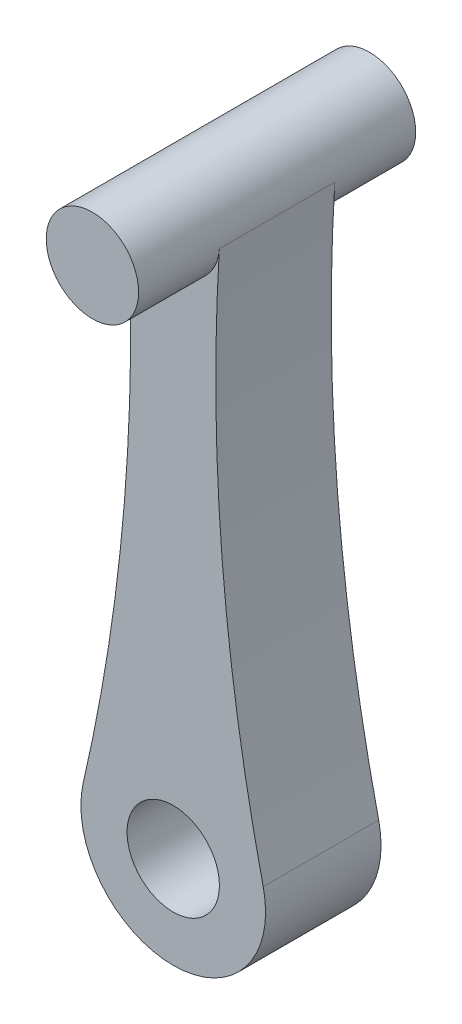
ISO-10303-21;
HEADER;
FILE_DESCRIPTION(('STEP AP214'),'2;1');
FILE_NAME('part.step','',(''),(''),'','','');
FILE_SCHEMA(('AUTOMOTIVE_DESIGN { 1 0 10303 214 1 1 1 1 }'));
ENDSEC;
DATA;
#1=APPLICATION_CONTEXT('core data for automotive mechanical design processes');
#2=APPLICATION_PROTOCOL_DEFINITION('international standard','automotive_design',2000,#1);
#3=PRODUCT_CONTEXT('',#1,'mechanical');
#4=PRODUCT('Part','Part','',(#3));
#5=PRODUCT_RELATED_PRODUCT_CATEGORY('part','',(#4));
#6=PRODUCT_DEFINITION_FORMATION('','',#4);
#7=PRODUCT_DEFINITION_CONTEXT('part definition',#1,'design');
#8=PRODUCT_DEFINITION('design','',#6,#7);
#9=PRODUCT_DEFINITION_SHAPE('','',#8);
#10=(LENGTH_UNIT() NAMED_UNIT(*) SI_UNIT(.MILLI.,.METRE.));
#11=(NAMED_UNIT(*) PLANE_ANGLE_UNIT() SI_UNIT($,.RADIAN.));
#12=(NAMED_UNIT(*) SI_UNIT($,.STERADIAN.) SOLID_ANGLE_UNIT());
#13=UNCERTAINTY_MEASURE_WITH_UNIT(LENGTH_MEASURE(1.E-05),#10,'distance_accuracy_value','');
#14=(GEOMETRIC_REPRESENTATION_CONTEXT(3) GLOBAL_UNCERTAINTY_ASSIGNED_CONTEXT((#13)) GLOBAL_UNIT_ASSIGNED_CONTEXT((#10,
#11,#12)) REPRESENTATION_CONTEXT('',''));
#15=CARTESIAN_POINT('',(0.,0.,0.));
#16=DIRECTION('',(0.,0.,1.));
#17=DIRECTION('',(1.,0.,0.));
#18=AXIS2_PLACEMENT_3D('',#15,#16,#17);
#19=CARTESIAN_POINT('',(-204.605714152584,-12.7083333333333,-12.5));
#20=DIRECTION('',(0.,0.,-1.));
#21=DIRECTION('',(-1.,0.,0.));
#22=AXIS2_PLACEMENT_3D('',#19,#20,#21);
#23=PLANE('',#22);
#24=CARTESIAN_POINT('',(0.,-60.,-12.5));
#25=DIRECTION('',(0.,0.,1.));
#26=DIRECTION('',(1.,0.,0.));
#27=AXIS2_PLACEMENT_3D('',#24,#25,#26);
#28=CIRCLE('',#27,10.);
#29=CARTESIAN_POINT('',(10.,-60.,-12.5));
#30=VERTEX_POINT('',#29);
#31=EDGE_CURVE('E108',#30,#30,#28,.T.);
#32=ORIENTED_EDGE('',*,*,#31,.T.);
#33=EDGE_LOOP('',(#32));
#34=FACE_BOUND('',#33,.T.);
#35=CARTESIAN_POINT('',(-409.211428305168,34.5833333333333,-12.5));
#36=DIRECTION('',(0.,0.,-1.));
#37=DIRECTION('',(-1.,0.,0.));
#38=AXIS2_PLACEMENT_3D('',#35,#36,#37);
#39=CIRCLE('',#38,400.);
#40=CARTESIAN_POINT('',(-9.98076654402844,59.380081300813,-12.5));
#41=VERTEX_POINT('',#40);
#42=CARTESIAN_POINT('',(-19.4862584907223,-55.4960317460317,-12.5));
#43=VERTEX_POINT('',#42);
#44=EDGE_CURVE('E89',#41,#43,#39,.T.);
#45=ORIENTED_EDGE('',*,*,#44,.F.);
#46=CARTESIAN_POINT('',(0.,60.,-12.5));
#47=DIRECTION('',(0.,0.,1.));
#48=DIRECTION('',(1.,0.,0.));
#49=AXIS2_PLACEMENT_3D('',#46,#47,#48);
#50=CIRCLE('',#49,9.99999999999997);
#51=CARTESIAN_POINT('',(9.98076654402847,59.380081300813,-12.5));
#52=VERTEX_POINT('',#51);
#53=EDGE_CURVE('E58',#41,#52,#50,.T.);
#54=ORIENTED_EDGE('',*,*,#53,.T.);
#55=CARTESIAN_POINT('',(409.211428305168,34.5833333333334,-12.5));
#56=DIRECTION('',(0.,0.,-1.));
#57=DIRECTION('',(1.,0.,0.));
#58=AXIS2_PLACEMENT_3D('',#55,#56,#57);
#59=CIRCLE('',#58,400.);
#60=CARTESIAN_POINT('',(19.4862584907222,-55.4960317460316,-12.5));
#61=VERTEX_POINT('',#60);
#62=EDGE_CURVE('E86',#61,#52,#59,.T.);
#63=ORIENTED_EDGE('',*,*,#62,.F.);
#64=CARTESIAN_POINT('',(0.,-60.,-12.5));
#65=DIRECTION('',(0.,0.,1.));
#66=DIRECTION('',(1.,0.,0.));
#67=AXIS2_PLACEMENT_3D('',#64,#65,#66);
#68=CIRCLE('',#67,20.);
#69=EDGE_CURVE('E101',#43,#61,#68,.T.);
#70=ORIENTED_EDGE('',*,*,#69,.F.);
#71=EDGE_LOOP('',(#45,#54,#63,#70));
#72=FACE_BOUND('',#71,.T.);
#73=ADVANCED_FACE('F42',(#34,#72),#23,.T.);
#74=CARTESIAN_POINT('',(-204.605714152584,-12.7083333333333,12.5));
#75=DIRECTION('',(0.,0.,-1.));
#76=DIRECTION('',(-1.,0.,0.));
#77=AXIS2_PLACEMENT_3D('',#74,#75,#76);
#78=PLANE('',#77);
#79=CARTESIAN_POINT('',(0.,-60.,12.5));
#80=DIRECTION('',(0.,0.,1.));
#81=DIRECTION('',(1.,0.,0.));
#82=AXIS2_PLACEMENT_3D('',#79,#80,#81);
#83=CIRCLE('',#82,10.);
#84=CARTESIAN_POINT('',(10.,-60.,12.5));
#85=VERTEX_POINT('',#84);
#86=EDGE_CURVE('E118',#85,#85,#83,.T.);
#87=ORIENTED_EDGE('',*,*,#86,.F.);
#88=EDGE_LOOP('',(#87));
#89=FACE_BOUND('',#88,.T.);
#90=CARTESIAN_POINT('',(0.,60.,12.5));
#91=DIRECTION('',(0.,0.,1.));
#92=DIRECTION('',(1.,0.,0.));
#93=AXIS2_PLACEMENT_3D('',#90,#91,#92);
#94=CIRCLE('',#93,9.99999999999997);
#95=CARTESIAN_POINT('',(-9.98076654402844,59.380081300813,12.5));
#96=VERTEX_POINT('',#95);
#97=CARTESIAN_POINT('',(9.98076654402847,59.380081300813,12.5));
#98=VERTEX_POINT('',#97);
#99=EDGE_CURVE('E96',#96,#98,#94,.T.);
#100=ORIENTED_EDGE('',*,*,#99,.F.);
#101=CARTESIAN_POINT('',(-409.211428305168,34.5833333333333,12.5));
#102=DIRECTION('',(0.,0.,-1.));
#103=DIRECTION('',(-1.,0.,0.));
#104=AXIS2_PLACEMENT_3D('',#101,#102,#103);
#105=CIRCLE('',#104,400.);
#106=CARTESIAN_POINT('',(-19.4862584907223,-55.4960317460317,12.5));
#107=VERTEX_POINT('',#106);
#108=EDGE_CURVE('E125',#96,#107,#105,.T.);
#109=ORIENTED_EDGE('',*,*,#108,.T.);
#110=CARTESIAN_POINT('',(0.,-60.,12.5));
#111=DIRECTION('',(0.,0.,1.));
#112=DIRECTION('',(1.,0.,0.));
#113=AXIS2_PLACEMENT_3D('',#110,#111,#112);
#114=CIRCLE('',#113,20.);
#115=CARTESIAN_POINT('',(19.4862584907222,-55.4960317460316,12.5));
#116=VERTEX_POINT('',#115);
#117=EDGE_CURVE('E128',#107,#116,#114,.T.);
#118=ORIENTED_EDGE('',*,*,#117,.T.);
#119=CARTESIAN_POINT('',(409.211428305168,34.5833333333334,12.5));
#120=DIRECTION('',(0.,0.,-1.));
#121=DIRECTION('',(1.,0.,0.));
#122=AXIS2_PLACEMENT_3D('',#119,#120,#121);
#123=CIRCLE('',#122,400.);
#124=EDGE_CURVE('E134',#116,#98,#123,.T.);
#125=ORIENTED_EDGE('',*,*,#124,.T.);
#126=EDGE_LOOP('',(#100,#109,#118,#125));
#127=FACE_BOUND('',#126,.T.);
#128=ADVANCED_FACE('F143',(#89,#127),#78,.F.);
#129=CARTESIAN_POINT('',(-409.211428305168,34.5833333333333,-12.5));
#130=DIRECTION('',(0.,0.,1.));
#131=DIRECTION('',(1.,0.,0.));
#132=AXIS2_PLACEMENT_3D('',#129,#130,#131);
#133=CYLINDRICAL_SURFACE('',#132,400.);
#134=DIRECTION('',(0.,0.,1.));
#135=VECTOR('',#134,1.);
#136=CARTESIAN_POINT('',(-19.4862584907223,-55.4960317460317,-12.5));
#137=LINE('',#136,#135);
#138=EDGE_CURVE('E100',#43,#107,#137,.T.);
#139=ORIENTED_EDGE('',*,*,#138,.T.);
#140=ORIENTED_EDGE('',*,*,#108,.F.);
#141=DIRECTION('',(0.,0.,1.));
#142=VECTOR('',#141,1.);
#143=CARTESIAN_POINT('',(-9.98076654402844,59.380081300813,-12.5));
#144=LINE('',#143,#142);
#145=EDGE_CURVE('E11',#41,#96,#144,.T.);
#146=ORIENTED_EDGE('',*,*,#145,.F.);
#147=ORIENTED_EDGE('',*,*,#44,.T.);
#148=EDGE_LOOP('',(#139,#140,#146,#147));
#149=FACE_BOUND('',#148,.T.);
#150=ADVANCED_FACE('F44',(#149),#133,.F.);
#151=CARTESIAN_POINT('',(0.,60.,-12.5));
#152=DIRECTION('',(0.,0.,1.));
#153=DIRECTION('',(1.,0.,0.));
#154=AXIS2_PLACEMENT_3D('',#151,#152,#153);
#155=CYLINDRICAL_SURFACE('',#154,9.99999999999997);
#156=ORIENTED_EDGE('',*,*,#145,.T.);
#157=ORIENTED_EDGE('',*,*,#99,.T.);
#158=DIRECTION('',(0.,0.,1.));
#159=VECTOR('',#158,1.);
#160=CARTESIAN_POINT('',(9.98076654402847,59.380081300813,-12.5));
#161=LINE('',#160,#159);
#162=EDGE_CURVE('E51',#52,#98,#161,.T.);
#163=ORIENTED_EDGE('',*,*,#162,.F.);
#164=ORIENTED_EDGE('',*,*,#53,.F.);
#165=EDGE_LOOP('',(#156,#157,#163,#164));
#166=FACE_BOUND('',#165,.T.);
#167=CARTESIAN_POINT('',(0.,60.,30.));
#168=DIRECTION('',(0.,0.,1.));
#169=DIRECTION('',(1.,0.,0.));
#170=AXIS2_PLACEMENT_3D('',#167,#168,#169);
#171=CIRCLE('',#170,9.99999999999997);
#172=CARTESIAN_POINT('',(9.99999999999999,60.,30.));
#173=VERTEX_POINT('',#172);
#174=EDGE_CURVE('E115',#173,#173,#171,.T.);
#175=ORIENTED_EDGE('',*,*,#174,.F.);
#176=EDGE_LOOP('',(#175));
#177=FACE_BOUND('',#176,.T.);
#178=CARTESIAN_POINT('',(0.,60.,-30.));
#179=DIRECTION('',(0.,0.,1.));
#180=DIRECTION('',(1.,0.,0.));
#181=AXIS2_PLACEMENT_3D('',#178,#179,#180);
#182=CIRCLE('',#181,9.99999999999997);
#183=CARTESIAN_POINT('',(9.99999999999999,60.,-30.));
#184=VERTEX_POINT('',#183);
#185=EDGE_CURVE('E90',#184,#184,#182,.T.);
#186=ORIENTED_EDGE('',*,*,#185,.T.);
#187=EDGE_LOOP('',(#186));
#188=FACE_BOUND('',#187,.T.);
#189=ADVANCED_FACE('F93',(#166,#177,#188),#155,.T.);
#190=CARTESIAN_POINT('',(409.211428305168,34.5833333333334,-12.5));
#191=DIRECTION('',(0.,0.,1.));
#192=DIRECTION('',(1.,0.,0.));
#193=AXIS2_PLACEMENT_3D('',#190,#191,#192);
#194=CYLINDRICAL_SURFACE('',#193,400.);
#195=ORIENTED_EDGE('',*,*,#162,.T.);
#196=ORIENTED_EDGE('',*,*,#124,.F.);
#197=DIRECTION('',(0.,0.,1.));
#198=VECTOR('',#197,1.);
#199=CARTESIAN_POINT('',(19.4862584907222,-55.4960317460316,-12.5));
#200=LINE('',#199,#198);
#201=EDGE_CURVE('E66',#61,#116,#200,.T.);
#202=ORIENTED_EDGE('',*,*,#201,.F.);
#203=ORIENTED_EDGE('',*,*,#62,.T.);
#204=EDGE_LOOP('',(#195,#196,#202,#203));
#205=FACE_BOUND('',#204,.T.);
#206=ADVANCED_FACE('F99',(#205),#194,.F.);
#207=CARTESIAN_POINT('',(0.,-60.,-12.5));
#208=DIRECTION('',(0.,0.,1.));
#209=DIRECTION('',(1.,0.,0.));
#210=AXIS2_PLACEMENT_3D('',#207,#208,#209);
#211=CYLINDRICAL_SURFACE('',#210,20.);
#212=ORIENTED_EDGE('',*,*,#201,.T.);
#213=ORIENTED_EDGE('',*,*,#117,.F.);
#214=ORIENTED_EDGE('',*,*,#138,.F.);
#215=ORIENTED_EDGE('',*,*,#69,.T.);
#216=EDGE_LOOP('',(#212,#213,#214,#215));
#217=FACE_BOUND('',#216,.T.);
#218=ADVANCED_FACE('F141',(#217),#211,.T.);
#219=CARTESIAN_POINT('',(0.,-60.,-12.5));
#220=DIRECTION('',(0.,0.,1.));
#221=DIRECTION('',(1.,0.,0.));
#222=AXIS2_PLACEMENT_3D('',#219,#220,#221);
#223=CYLINDRICAL_SURFACE('',#222,10.);
#224=ORIENTED_EDGE('',*,*,#31,.F.);
#225=EDGE_LOOP('',(#224));
#226=FACE_BOUND('',#225,.T.);
#227=ORIENTED_EDGE('',*,*,#86,.T.);
#228=EDGE_LOOP('',(#227));
#229=FACE_BOUND('',#228,.T.);
#230=ADVANCED_FACE('F158',(#226,#229),#223,.F.);
#231=CARTESIAN_POINT('',(0.,60.,30.));
#232=DIRECTION('',(0.,0.,1.));
#233=DIRECTION('',(1.,0.,0.));
#234=AXIS2_PLACEMENT_3D('',#231,#232,#233);
#235=PLANE('',#234);
#236=ORIENTED_EDGE('',*,*,#174,.T.);
#237=EDGE_LOOP('',(#236));
#238=FACE_BOUND('',#237,.T.);
#239=ADVANCED_FACE('F156',(#238),#235,.T.);
#240=CARTESIAN_POINT('',(0.,60.,-30.));
#241=DIRECTION('',(0.,0.,-1.));
#242=DIRECTION('',(1.,0.,0.));
#243=AXIS2_PLACEMENT_3D('',#240,#241,#242);
#244=PLANE('',#243);
#245=ORIENTED_EDGE('',*,*,#185,.F.);
#246=EDGE_LOOP('',(#245));
#247=FACE_BOUND('',#246,.T.);
#248=ADVANCED_FACE('F180',(#247),#244,.T.);
#249=CLOSED_SHELL('',(#73,#128,#150,#189,#206,#218,#230,#239,#248));
#250=MANIFOLD_SOLID_BREP('B2',#249);
#251=ADVANCED_BREP_SHAPE_REPRESENTATION('',(#18,#250),#14);
#252=SHAPE_DEFINITION_REPRESENTATION(#9,#251);
ENDSEC;
END-ISO-10303-21;
